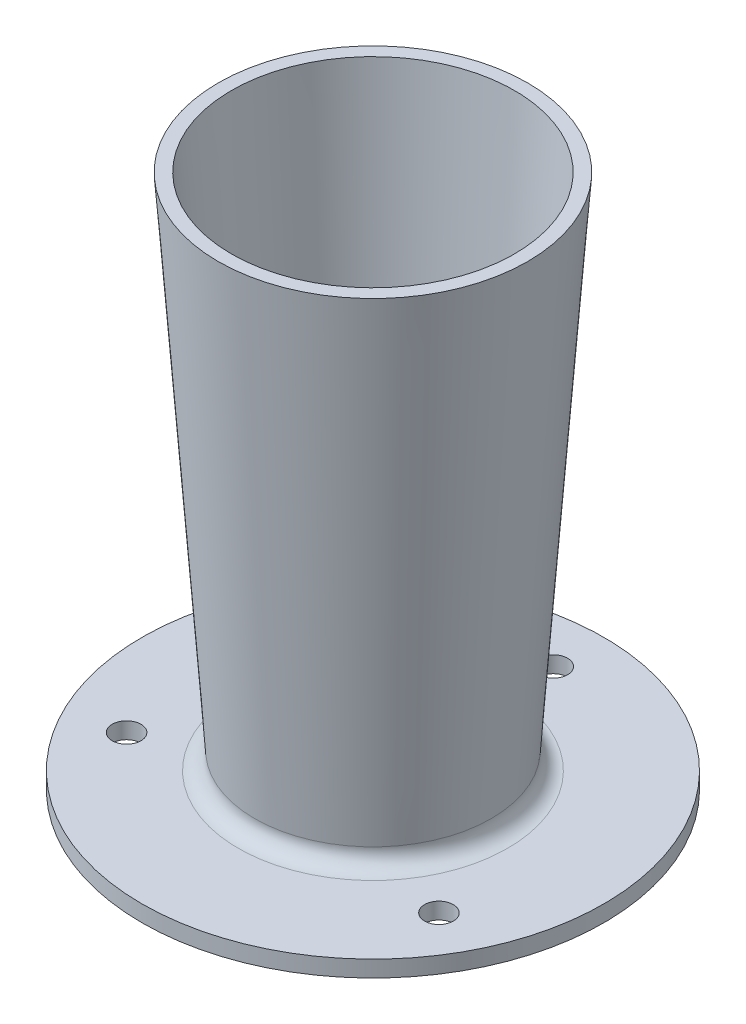
ISO-10303-21;
HEADER;
FILE_DESCRIPTION(('STEP AP214'),'2;1');
FILE_NAME('part.step','',(''),(''),'','','');
FILE_SCHEMA(('AUTOMOTIVE_DESIGN { 1 0 10303 214 1 1 1 1 }'));
ENDSEC;
DATA;
#1=APPLICATION_CONTEXT('core data for automotive mechanical design processes');
#2=APPLICATION_PROTOCOL_DEFINITION('international standard','automotive_design',2000,#1);
#3=PRODUCT_CONTEXT('',#1,'mechanical');
#4=PRODUCT('Part','Part','',(#3));
#5=PRODUCT_RELATED_PRODUCT_CATEGORY('part','',(#4));
#6=PRODUCT_DEFINITION_FORMATION('','',#4);
#7=PRODUCT_DEFINITION_CONTEXT('part definition',#1,'design');
#8=PRODUCT_DEFINITION('design','',#6,#7);
#9=PRODUCT_DEFINITION_SHAPE('','',#8);
#10=(LENGTH_UNIT() NAMED_UNIT(*) SI_UNIT(.MILLI.,.METRE.));
#11=(NAMED_UNIT(*) PLANE_ANGLE_UNIT() SI_UNIT($,.RADIAN.));
#12=(NAMED_UNIT(*) SI_UNIT($,.STERADIAN.) SOLID_ANGLE_UNIT());
#13=UNCERTAINTY_MEASURE_WITH_UNIT(LENGTH_MEASURE(1.E-05),#10,'distance_accuracy_value','');
#14=(GEOMETRIC_REPRESENTATION_CONTEXT(3) GLOBAL_UNCERTAINTY_ASSIGNED_CONTEXT((#13)) GLOBAL_UNIT_ASSIGNED_CONTEXT((#10,
#11,#12)) REPRESENTATION_CONTEXT('',''));
#15=CARTESIAN_POINT('',(0.,0.,0.));
#16=DIRECTION('',(0.,0.,1.));
#17=DIRECTION('',(1.,0.,0.));
#18=AXIS2_PLACEMENT_3D('',#15,#16,#17);
#19=CARTESIAN_POINT('',(28.1712119472535,0.,0.));
#20=DIRECTION('',(0.,1.,0.));
#21=DIRECTION('',(0.,0.,1.));
#22=AXIS2_PLACEMENT_3D('',#19,#20,#21);
#23=PLANE('',#22);
#24=CARTESIAN_POINT('',(-19.0525588832562,0.,11.0000000000009));
#25=DIRECTION('',(0.,1.,0.));
#26=DIRECTION('',(0.,0.,1.));
#27=AXIS2_PLACEMENT_3D('',#24,#25,#26);
#28=CIRCLE('',#27,1.75);
#29=CARTESIAN_POINT('',(-19.0525588832562,0.,12.7500000000009));
#30=VERTEX_POINT('',#29);
#31=EDGE_CURVE('E76',#30,#30,#28,.T.);
#32=ORIENTED_EDGE('',*,*,#31,.T.);
#33=EDGE_LOOP('',(#32));
#34=FACE_BOUND('',#33,.T.);
#35=CARTESIAN_POINT('',(19.0525588832591,0.,10.9999999999991));
#36=DIRECTION('',(0.,1.,0.));
#37=DIRECTION('',(0.,0.,1.));
#38=AXIS2_PLACEMENT_3D('',#35,#36,#37);
#39=CIRCLE('',#38,1.75);
#40=CARTESIAN_POINT('',(19.0525588832591,0.,12.7499999999991));
#41=VERTEX_POINT('',#40);
#42=EDGE_CURVE('E70',#41,#41,#39,.T.);
#43=ORIENTED_EDGE('',*,*,#42,.T.);
#44=EDGE_LOOP('',(#43));
#45=FACE_BOUND('',#44,.T.);
#46=CARTESIAN_POINT('',(0.,0.,-22.));
#47=DIRECTION('',(0.,1.,0.));
#48=DIRECTION('',(0.,0.,1.));
#49=AXIS2_PLACEMENT_3D('',#46,#47,#48);
#50=CIRCLE('',#49,1.75);
#51=CARTESIAN_POINT('',(0.,0.,-20.25));
#52=VERTEX_POINT('',#51);
#53=EDGE_CURVE('E66',#52,#52,#50,.T.);
#54=ORIENTED_EDGE('',*,*,#53,.T.);
#55=EDGE_LOOP('',(#54));
#56=FACE_BOUND('',#55,.T.);
#57=CARTESIAN_POINT('',(0.,0.,0.));
#58=DIRECTION('',(0.,1.,0.));
#59=DIRECTION('',(0.,0.,1.));
#60=AXIS2_PLACEMENT_3D('',#57,#58,#59);
#61=CIRCLE('',#60,28.1712119472535);
#62=CARTESIAN_POINT('',(0.,0.,28.1712119472535));
#63=VERTEX_POINT('',#62);
#64=EDGE_CURVE('E63',#63,#63,#61,.T.);
#65=ORIENTED_EDGE('',*,*,#64,.F.);
#66=EDGE_LOOP('',(#65));
#67=FACE_BOUND('',#66,.T.);
#68=CARTESIAN_POINT('',(0.,0.,0.));
#69=DIRECTION('',(0.,1.,0.));
#70=DIRECTION('',(0.,0.,1.));
#71=AXIS2_PLACEMENT_3D('',#68,#69,#70);
#72=CIRCLE('',#71,11.5);
#73=CARTESIAN_POINT('',(0.,0.,11.5));
#74=VERTEX_POINT('',#73);
#75=EDGE_CURVE('E42',#74,#74,#72,.T.);
#76=ORIENTED_EDGE('',*,*,#75,.T.);
#77=EDGE_LOOP('',(#76));
#78=FACE_BOUND('',#77,.T.);
#79=ADVANCED_FACE('F31',(#34,#45,#56,#67,#78),#23,.F.);
#80=CARTESIAN_POINT('',(0.,70.0734722806969,0.));
#81=DIRECTION('',(0.,1.,0.));
#82=DIRECTION('',(0.,0.,1.));
#83=AXIS2_PLACEMENT_3D('',#80,#81,#82);
#84=CYLINDRICAL_SURFACE('',#83,11.5);
#85=ORIENTED_EDGE('',*,*,#75,.F.);
#86=EDGE_LOOP('',(#85));
#87=FACE_BOUND('',#86,.T.);
#88=CARTESIAN_POINT('',(0.,20.2223866465719,0.));
#89=DIRECTION('',(0.,1.,0.));
#90=DIRECTION('',(0.,0.,1.));
#91=AXIS2_PLACEMENT_3D('',#88,#89,#90);
#92=CIRCLE('',#91,11.5);
#93=CARTESIAN_POINT('',(0.,20.2223866465719,11.5));
#94=VERTEX_POINT('',#93);
#95=EDGE_CURVE('E46',#94,#94,#92,.T.);
#96=ORIENTED_EDGE('',*,*,#95,.T.);
#97=EDGE_LOOP('',(#96));
#98=FACE_BOUND('',#97,.T.);
#99=ADVANCED_FACE('F113',(#87,#98),#84,.F.);
#100=CARTESIAN_POINT('',(11.5,20.2223866465719,0.));
#101=DIRECTION('',(0.,-1.,0.));
#102=DIRECTION('',(0.,0.,-1.));
#103=AXIS2_PLACEMENT_3D('',#100,#101,#102);
#104=PLANE('',#103);
#105=ORIENTED_EDGE('',*,*,#95,.F.);
#106=EDGE_LOOP('',(#105));
#107=FACE_BOUND('',#106,.T.);
#108=CARTESIAN_POINT('',(0.,20.2223866465719,0.));
#109=DIRECTION('',(0.,1.,0.));
#110=DIRECTION('',(0.,0.,1.));
#111=AXIS2_PLACEMENT_3D('',#108,#109,#110);
#112=CIRCLE('',#111,14.);
#113=CARTESIAN_POINT('',(0.,20.2223866465719,14.));
#114=VERTEX_POINT('',#113);
#115=EDGE_CURVE('E51',#114,#114,#112,.T.);
#116=ORIENTED_EDGE('',*,*,#115,.T.);
#117=EDGE_LOOP('',(#116));
#118=FACE_BOUND('',#117,.T.);
#119=ADVANCED_FACE('F118',(#107,#118),#104,.F.);
#120=CARTESIAN_POINT('',(0.,65.2223866465719,0.));
#121=DIRECTION('',(0.,1.,0.));
#122=DIRECTION('',(0.,0.,1.));
#123=AXIS2_PLACEMENT_3D('',#120,#121,#122);
#124=CONICAL_SURFACE('',#123,17.2730097006899,0.0726056968829603);
#125=ORIENTED_EDGE('',*,*,#115,.F.);
#126=EDGE_LOOP('',(#125));
#127=FACE_BOUND('',#126,.T.);
#128=CARTESIAN_POINT('',(0.,65.2223866465719,0.));
#129=DIRECTION('',(0.,1.,0.));
#130=DIRECTION('',(0.,0.,1.));
#131=AXIS2_PLACEMENT_3D('',#128,#129,#130);
#132=CIRCLE('',#131,17.2730097006899);
#133=CARTESIAN_POINT('',(0.,65.2223866465719,17.2730097006899));
#134=VERTEX_POINT('',#133);
#135=EDGE_CURVE('E54',#134,#134,#132,.T.);
#136=ORIENTED_EDGE('',*,*,#135,.T.);
#137=EDGE_LOOP('',(#136));
#138=FACE_BOUND('',#137,.T.);
#139=ADVANCED_FACE('F124',(#127,#138),#124,.F.);
#140=CARTESIAN_POINT('',(17.2730097006899,65.2223866465719,0.));
#141=DIRECTION('',(0.,-1.,0.));
#142=DIRECTION('',(0.,0.,-1.));
#143=AXIS2_PLACEMENT_3D('',#140,#141,#142);
#144=PLANE('',#143);
#145=ORIENTED_EDGE('',*,*,#135,.F.);
#146=EDGE_LOOP('',(#145));
#147=FACE_BOUND('',#146,.T.);
#148=CARTESIAN_POINT('',(0.,65.2223866465719,0.));
#149=DIRECTION('',(0.,1.,0.));
#150=DIRECTION('',(0.,0.,1.));
#151=AXIS2_PLACEMENT_3D('',#148,#149,#150);
#152=CIRCLE('',#151,18.8772362535773);
#153=CARTESIAN_POINT('',(0.,65.2223866465719,18.8772362535773));
#154=VERTEX_POINT('',#153);
#155=EDGE_CURVE('E57',#154,#154,#152,.T.);
#156=ORIENTED_EDGE('',*,*,#155,.T.);
#157=EDGE_LOOP('',(#156));
#158=FACE_BOUND('',#157,.T.);
#159=ADVANCED_FACE('F130',(#147,#158),#144,.F.);
#160=CARTESIAN_POINT('',(0.,2.,0.));
#161=DIRECTION('',(0.,1.,0.));
#162=DIRECTION('',(0.,0.,1.));
#163=AXIS2_PLACEMENT_3D('',#160,#161,#162);
#164=CONICAL_SURFACE('',#163,14.2788477025773,0.0726056968829602);
#165=CARTESIAN_POINT('',(0.,4.14508384496853,0.));
#166=DIRECTION('',(0.,1.,0.));
#167=DIRECTION('',(0.,0.,1.));
#168=AXIS2_PLACEMENT_3D('',#165,#166,#167);
#169=CIRCLE('',#168,14.4348672633189);
#170=CARTESIAN_POINT('',(0.,4.14508384496853,14.4348672633189));
#171=VERTEX_POINT('',#170);
#172=EDGE_CURVE('E38',#171,#171,#169,.T.);
#173=ORIENTED_EDGE('',*,*,#172,.T.);
#174=EDGE_LOOP('',(#173));
#175=FACE_BOUND('',#174,.T.);
#176=ORIENTED_EDGE('',*,*,#155,.F.);
#177=EDGE_LOOP('',(#176));
#178=FACE_BOUND('',#177,.T.);
#179=ADVANCED_FACE('F98',(#175,#178),#164,.T.);
#180=CARTESIAN_POINT('',(28.1712119472535,2.,0.));
#181=DIRECTION('',(0.,-1.,0.));
#182=DIRECTION('',(0.,0.,-1.));
#183=AXIS2_PLACEMENT_3D('',#180,#181,#182);
#184=PLANE('',#183);
#185=CARTESIAN_POINT('',(-19.0525588832562,2.,11.0000000000009));
#186=DIRECTION('',(0.,1.,0.));
#187=DIRECTION('',(0.,0.,1.));
#188=AXIS2_PLACEMENT_3D('',#185,#186,#187);
#189=CIRCLE('',#188,1.75);
#190=CARTESIAN_POINT('',(-19.0525588832562,2.,12.7500000000009));
#191=VERTEX_POINT('',#190);
#192=EDGE_CURVE('E79',#191,#191,#189,.T.);
#193=ORIENTED_EDGE('',*,*,#192,.F.);
#194=EDGE_LOOP('',(#193));
#195=FACE_BOUND('',#194,.T.);
#196=CARTESIAN_POINT('',(19.0525588832591,2.,10.9999999999991));
#197=DIRECTION('',(0.,1.,0.));
#198=DIRECTION('',(0.,0.,1.));
#199=AXIS2_PLACEMENT_3D('',#196,#197,#198);
#200=CIRCLE('',#199,1.75);
#201=CARTESIAN_POINT('',(19.0525588832591,2.,12.7499999999991));
#202=VERTEX_POINT('',#201);
#203=EDGE_CURVE('E73',#202,#202,#200,.T.);
#204=ORIENTED_EDGE('',*,*,#203,.F.);
#205=EDGE_LOOP('',(#204));
#206=FACE_BOUND('',#205,.T.);
#207=CARTESIAN_POINT('',(0.,2.,-22.));
#208=DIRECTION('',(0.,1.,0.));
#209=DIRECTION('',(0.,0.,1.));
#210=AXIS2_PLACEMENT_3D('',#207,#208,#209);
#211=CIRCLE('',#210,1.75);
#212=CARTESIAN_POINT('',(0.,2.,-20.25));
#213=VERTEX_POINT('',#212);
#214=EDGE_CURVE('E67',#213,#213,#211,.T.);
#215=ORIENTED_EDGE('',*,*,#214,.F.);
#216=EDGE_LOOP('',(#215));
#217=FACE_BOUND('',#216,.T.);
#218=CARTESIAN_POINT('',(0.,2.,0.));
#219=DIRECTION('',(0.,-1.,0.));
#220=DIRECTION('',(0.,0.,-1.));
#221=AXIS2_PLACEMENT_3D('',#218,#219,#220);
#222=CIRCLE('',#221,16.4295979914948);
#223=CARTESIAN_POINT('',(0.,2.,-16.4295979914948));
#224=VERTEX_POINT('',#223);
#225=EDGE_CURVE('E10',#224,#224,#222,.T.);
#226=ORIENTED_EDGE('',*,*,#225,.T.);
#227=EDGE_LOOP('',(#226));
#228=FACE_BOUND('',#227,.T.);
#229=CARTESIAN_POINT('',(0.,2.,0.));
#230=DIRECTION('',(0.,1.,0.));
#231=DIRECTION('',(0.,0.,1.));
#232=AXIS2_PLACEMENT_3D('',#229,#230,#231);
#233=CIRCLE('',#232,28.1712119472535);
#234=CARTESIAN_POINT('',(0.,2.,28.1712119472535));
#235=VERTEX_POINT('',#234);
#236=EDGE_CURVE('E60',#235,#235,#233,.T.);
#237=ORIENTED_EDGE('',*,*,#236,.T.);
#238=EDGE_LOOP('',(#237));
#239=FACE_BOUND('',#238,.T.);
#240=ADVANCED_FACE('F94',(#195,#206,#217,#228,#239),#184,.F.);
#241=CARTESIAN_POINT('',(0.,70.0734722806969,0.));
#242=DIRECTION('',(0.,1.,0.));
#243=DIRECTION('',(0.,0.,1.));
#244=AXIS2_PLACEMENT_3D('',#241,#242,#243);
#245=CYLINDRICAL_SURFACE('',#244,28.1712119472535);
#246=ORIENTED_EDGE('',*,*,#236,.F.);
#247=EDGE_LOOP('',(#246));
#248=FACE_BOUND('',#247,.T.);
#249=ORIENTED_EDGE('',*,*,#64,.T.);
#250=EDGE_LOOP('',(#249));
#251=FACE_BOUND('',#250,.T.);
#252=ADVANCED_FACE('F97',(#248,#251),#245,.T.);
#253=CARTESIAN_POINT('',(0.,4.,0.));
#254=DIRECTION('',(0.,-1.,0.));
#255=DIRECTION('',(0.,0.,-1.));
#256=AXIS2_PLACEMENT_3D('',#253,#254,#255);
#257=TOROIDAL_SURFACE('',#256,16.4295979914948,2.);
#258=ORIENTED_EDGE('',*,*,#225,.F.);
#259=EDGE_LOOP('',(#258));
#260=FACE_BOUND('',#259,.T.);
#261=ORIENTED_EDGE('',*,*,#172,.F.);
#262=EDGE_LOOP('',(#261));
#263=FACE_BOUND('',#262,.T.);
#264=ADVANCED_FACE('F33',(#260,#263),#257,.F.);
#265=CARTESIAN_POINT('',(0.,0.,-22.));
#266=DIRECTION('',(0.,1.,0.));
#267=DIRECTION('',(0.,0.,1.));
#268=AXIS2_PLACEMENT_3D('',#265,#266,#267);
#269=CYLINDRICAL_SURFACE('',#268,1.75);
#270=ORIENTED_EDGE('',*,*,#53,.F.);
#271=EDGE_LOOP('',(#270));
#272=FACE_BOUND('',#271,.T.);
#273=ORIENTED_EDGE('',*,*,#214,.T.);
#274=EDGE_LOOP('',(#273));
#275=FACE_BOUND('',#274,.T.);
#276=ADVANCED_FACE('F144',(#272,#275),#269,.F.);
#277=CARTESIAN_POINT('',(19.0525588832591,0.,10.9999999999991));
#278=DIRECTION('',(0.,1.,0.));
#279=DIRECTION('',(0.,0.,1.));
#280=AXIS2_PLACEMENT_3D('',#277,#278,#279);
#281=CYLINDRICAL_SURFACE('',#280,1.75);
#282=ORIENTED_EDGE('',*,*,#42,.F.);
#283=EDGE_LOOP('',(#282));
#284=FACE_BOUND('',#283,.T.);
#285=ORIENTED_EDGE('',*,*,#203,.T.);
#286=EDGE_LOOP('',(#285));
#287=FACE_BOUND('',#286,.T.);
#288=ADVANCED_FACE('F90',(#284,#287),#281,.F.);
#289=CARTESIAN_POINT('',(-19.0525588832562,0.,11.0000000000009));
#290=DIRECTION('',(0.,1.,0.));
#291=DIRECTION('',(0.,0.,1.));
#292=AXIS2_PLACEMENT_3D('',#289,#290,#291);
#293=CYLINDRICAL_SURFACE('',#292,1.75);
#294=ORIENTED_EDGE('',*,*,#31,.F.);
#295=EDGE_LOOP('',(#294));
#296=FACE_BOUND('',#295,.T.);
#297=ORIENTED_EDGE('',*,*,#192,.T.);
#298=EDGE_LOOP('',(#297));
#299=FACE_BOUND('',#298,.T.);
#300=ADVANCED_FACE('F87',(#296,#299),#293,.F.);
#301=CLOSED_SHELL('',(#79,#99,#119,#139,#159,#179,#240,#252,#264,#276,#288,#300));
#302=MANIFOLD_SOLID_BREP('B2',#301);
#303=ADVANCED_BREP_SHAPE_REPRESENTATION('',(#18,#302),#14);
#304=SHAPE_DEFINITION_REPRESENTATION(#9,#303);
ENDSEC;
END-ISO-10303-21;
